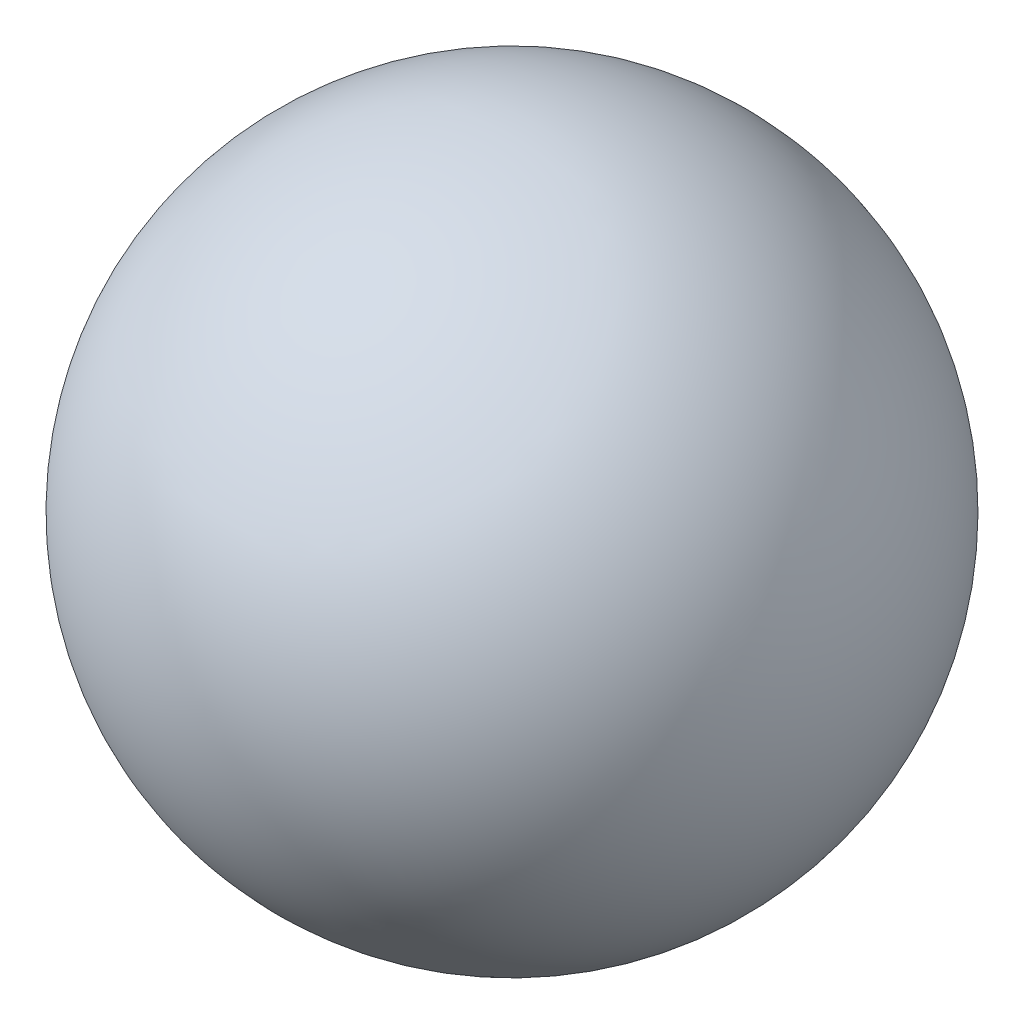
ISO-10303-21;
HEADER;
FILE_DESCRIPTION(('STEP AP214'),'2;1');
FILE_NAME('part.step','',(''),(''),'','','');
FILE_SCHEMA(('AUTOMOTIVE_DESIGN { 1 0 10303 214 1 1 1 1 }'));
ENDSEC;
DATA;
#1=APPLICATION_CONTEXT('core data for automotive mechanical design processes');
#2=APPLICATION_PROTOCOL_DEFINITION('international standard','automotive_design',2000,#1);
#3=PRODUCT_CONTEXT('',#1,'mechanical');
#4=PRODUCT('Part','Part','',(#3));
#5=PRODUCT_RELATED_PRODUCT_CATEGORY('part','',(#4));
#6=PRODUCT_DEFINITION_FORMATION('','',#4);
#7=PRODUCT_DEFINITION_CONTEXT('part definition',#1,'design');
#8=PRODUCT_DEFINITION('design','',#6,#7);
#9=PRODUCT_DEFINITION_SHAPE('','',#8);
#10=(LENGTH_UNIT() NAMED_UNIT(*) SI_UNIT(.MILLI.,.METRE.));
#11=(NAMED_UNIT(*) PLANE_ANGLE_UNIT() SI_UNIT($,.RADIAN.));
#12=(NAMED_UNIT(*) SI_UNIT($,.STERADIAN.) SOLID_ANGLE_UNIT());
#13=UNCERTAINTY_MEASURE_WITH_UNIT(LENGTH_MEASURE(1.E-05),#10,'distance_accuracy_value','');
#14=(GEOMETRIC_REPRESENTATION_CONTEXT(3) GLOBAL_UNCERTAINTY_ASSIGNED_CONTEXT((#13)) GLOBAL_UNIT_ASSIGNED_CONTEXT((#10,
#11,#12)) REPRESENTATION_CONTEXT('',''));
#15=CARTESIAN_POINT('',(0.,0.,0.));
#16=DIRECTION('',(0.,0.,1.));
#17=DIRECTION('',(1.,0.,0.));
#18=AXIS2_PLACEMENT_3D('',#15,#16,#17);
#19=CARTESIAN_POINT('',(57.535,-25.0057860964432,56.2213140539149));
#20=DIRECTION('',(0.,-0.406389996935606,0.91369971565645));
#21=DIRECTION('',(0.173648177666933,-0.899818563903522,-0.400216019728792));
#22=AXIS2_PLACEMENT_3D('',#19,#20,#21);
#23=SPHERICAL_SURFACE('',#22,6.75);
#24=CARTESIAN_POINT('',(57.535,-27.7489185757585,62.3887871345959));
#25=VERTEX_POINT('',#24);
#26=VERTEX_LOOP('',#25);
#27=FACE_BOUND('',#26,.T.);
#28=CARTESIAN_POINT('',(57.535,-22.2626536171279,50.0538409732339));
#29=VERTEX_POINT('',#28);
#30=VERTEX_LOOP('',#29);
#31=FACE_BOUND('',#30,.T.);
#32=ADVANCED_FACE('F16',(#27,#31),#23,.T.);
#33=CLOSED_SHELL('',(#32));
#34=MANIFOLD_SOLID_BREP('B1',#33);
#35=ADVANCED_BREP_SHAPE_REPRESENTATION('',(#18,#34),#14);
#36=SHAPE_DEFINITION_REPRESENTATION(#9,#35);
ENDSEC;
END-ISO-10303-21;
